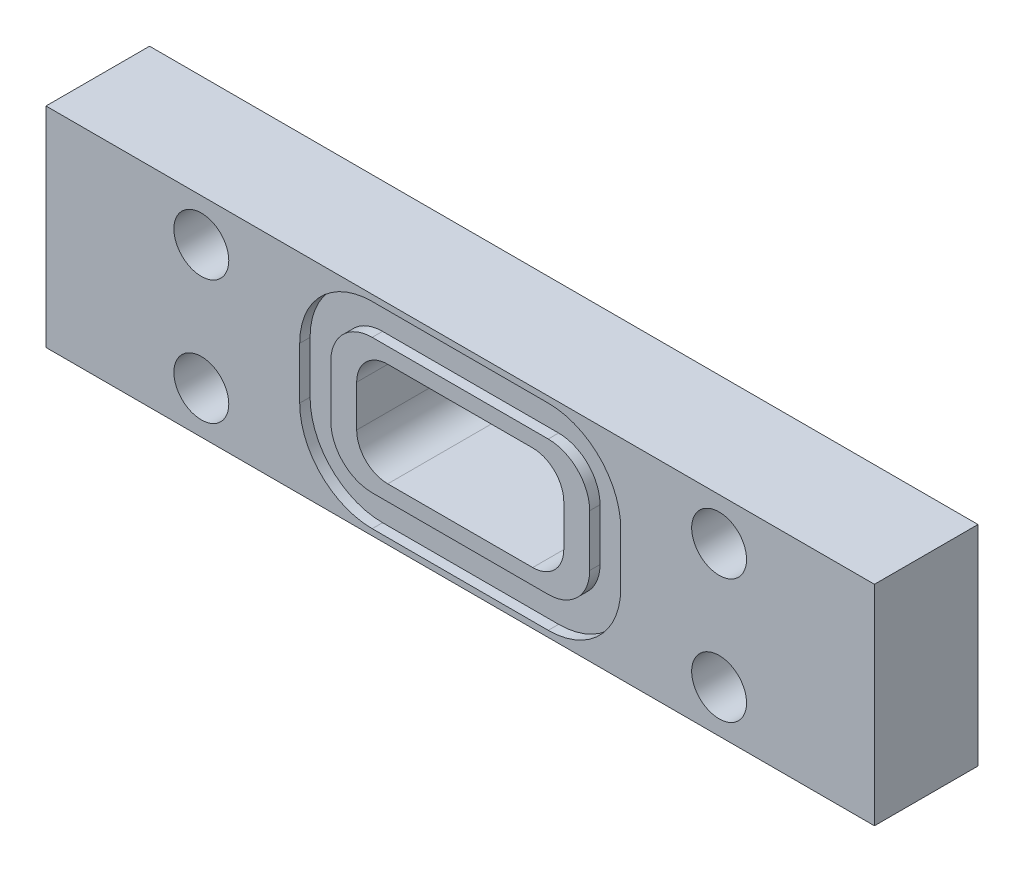
ISO-10303-21;
HEADER;
FILE_DESCRIPTION(('STEP AP214'),'2;1');
FILE_NAME('part.step','',(''),(''),'','','');
FILE_SCHEMA(('AUTOMOTIVE_DESIGN { 1 0 10303 214 1 1 1 1 }'));
ENDSEC;
DATA;
#1=APPLICATION_CONTEXT('core data for automotive mechanical design processes');
#2=APPLICATION_PROTOCOL_DEFINITION('international standard','automotive_design',2000,#1);
#3=PRODUCT_CONTEXT('',#1,'mechanical');
#4=PRODUCT('Part','Part','',(#3));
#5=PRODUCT_RELATED_PRODUCT_CATEGORY('part','',(#4));
#6=PRODUCT_DEFINITION_FORMATION('','',#4);
#7=PRODUCT_DEFINITION_CONTEXT('part definition',#1,'design');
#8=PRODUCT_DEFINITION('design','',#6,#7);
#9=PRODUCT_DEFINITION_SHAPE('','',#8);
#10=(LENGTH_UNIT() NAMED_UNIT(*) SI_UNIT(.MILLI.,.METRE.));
#11=(NAMED_UNIT(*) PLANE_ANGLE_UNIT() SI_UNIT($,.RADIAN.));
#12=(NAMED_UNIT(*) SI_UNIT($,.STERADIAN.) SOLID_ANGLE_UNIT());
#13=UNCERTAINTY_MEASURE_WITH_UNIT(LENGTH_MEASURE(1.E-05),#10,'distance_accuracy_value','');
#14=(GEOMETRIC_REPRESENTATION_CONTEXT(3) GLOBAL_UNCERTAINTY_ASSIGNED_CONTEXT((#13)) GLOBAL_UNIT_ASSIGNED_CONTEXT((#10,
#11,#12)) REPRESENTATION_CONTEXT('',''));
#15=CARTESIAN_POINT('',(0.,0.,0.));
#16=DIRECTION('',(0.,0.,1.));
#17=DIRECTION('',(1.,0.,0.));
#18=AXIS2_PLACEMENT_3D('',#15,#16,#17);
#19=CARTESIAN_POINT('',(0.,0.,10.));
#20=DIRECTION('',(0.,0.,-1.));
#21=DIRECTION('',(-1.,0.,0.));
#22=AXIS2_PLACEMENT_3D('',#19,#20,#21);
#23=PLANE('',#22);
#24=DIRECTION('',(0.,1.,0.));
#25=VECTOR('',#24,1.);
#26=CARTESIAN_POINT('',(50.,15.1,10.));
#27=LINE('',#26,#25);
#28=CARTESIAN_POINT('',(50.,8.1,10.));
#29=VERTEX_POINT('',#28);
#30=CARTESIAN_POINT('',(50.,12.1,10.));
#31=VERTEX_POINT('',#30);
#32=EDGE_CURVE('E389',#29,#31,#27,.T.);
#33=ORIENTED_EDGE('',*,*,#32,.F.);
#34=CARTESIAN_POINT('',(47.,8.1,10.));
#35=DIRECTION('',(0.,0.,-1.));
#36=DIRECTION('',(-1.,0.,0.));
#37=AXIS2_PLACEMENT_3D('',#34,#35,#36);
#38=CIRCLE('',#37,3.);
#39=CARTESIAN_POINT('',(47.,5.1,10.));
#40=VERTEX_POINT('',#39);
#41=EDGE_CURVE('E464',#29,#40,#38,.T.);
#42=ORIENTED_EDGE('',*,*,#41,.T.);
#43=DIRECTION('',(1.,0.,0.));
#44=VECTOR('',#43,1.);
#45=CARTESIAN_POINT('',(30.,5.1,10.));
#46=LINE('',#45,#44);
#47=CARTESIAN_POINT('',(33.,5.1,10.));
#48=VERTEX_POINT('',#47);
#49=EDGE_CURVE('E399',#48,#40,#46,.T.);
#50=ORIENTED_EDGE('',*,*,#49,.F.);
#51=CARTESIAN_POINT('',(33.,8.1,10.));
#52=DIRECTION('',(0.,0.,-1.));
#53=DIRECTION('',(-1.,0.,0.));
#54=AXIS2_PLACEMENT_3D('',#51,#52,#53);
#55=CIRCLE('',#54,3.);
#56=CARTESIAN_POINT('',(30.,8.1,10.));
#57=VERTEX_POINT('',#56);
#58=EDGE_CURVE('E468',#48,#57,#55,.T.);
#59=ORIENTED_EDGE('',*,*,#58,.T.);
#60=DIRECTION('',(0.,-1.,0.));
#61=VECTOR('',#60,1.);
#62=CARTESIAN_POINT('',(30.,15.1,10.));
#63=LINE('',#62,#61);
#64=CARTESIAN_POINT('',(30.,12.1,10.));
#65=VERTEX_POINT('',#64);
#66=EDGE_CURVE('E396',#65,#57,#63,.T.);
#67=ORIENTED_EDGE('',*,*,#66,.F.);
#68=CARTESIAN_POINT('',(33.,12.1,10.));
#69=DIRECTION('',(0.,0.,-1.));
#70=DIRECTION('',(-1.,0.,0.));
#71=AXIS2_PLACEMENT_3D('',#68,#69,#70);
#72=CIRCLE('',#71,3.);
#73=CARTESIAN_POINT('',(33.,15.1,10.));
#74=VERTEX_POINT('',#73);
#75=EDGE_CURVE('E13',#65,#74,#72,.T.);
#76=ORIENTED_EDGE('',*,*,#75,.T.);
#77=DIRECTION('',(-1.,0.,0.));
#78=VECTOR('',#77,1.);
#79=CARTESIAN_POINT('',(30.,15.1,10.));
#80=LINE('',#79,#78);
#81=CARTESIAN_POINT('',(47.,15.1,10.));
#82=VERTEX_POINT('',#81);
#83=EDGE_CURVE('E392',#82,#74,#80,.T.);
#84=ORIENTED_EDGE('',*,*,#83,.F.);
#85=CARTESIAN_POINT('',(47.,12.1,10.));
#86=DIRECTION('',(0.,0.,-1.));
#87=DIRECTION('',(-1.,0.,0.));
#88=AXIS2_PLACEMENT_3D('',#85,#86,#87);
#89=CIRCLE('',#88,3.);
#90=EDGE_CURVE('E472',#82,#31,#89,.T.);
#91=ORIENTED_EDGE('',*,*,#90,.T.);
#92=EDGE_LOOP('',(#33,#42,#50,#59,#67,#76,#84,#91));
#93=FACE_BOUND('',#92,.T.);
#94=CARTESIAN_POINT('',(48.5,12.6,10.));
#95=DIRECTION('',(0.,0.,1.));
#96=DIRECTION('',(-1.,0.,0.));
#97=AXIS2_PLACEMENT_3D('',#94,#95,#96);
#98=CIRCLE('',#97,4.);
#99=CARTESIAN_POINT('',(52.5,12.6,10.));
#100=VERTEX_POINT('',#99);
#101=CARTESIAN_POINT('',(48.5,16.6,10.));
#102=VERTEX_POINT('',#101);
#103=EDGE_CURVE('E275',#100,#102,#98,.T.);
#104=ORIENTED_EDGE('',*,*,#103,.T.);
#105=DIRECTION('',(-1.,0.,0.));
#106=VECTOR('',#105,1.);
#107=CARTESIAN_POINT('',(48.5,16.6,10.));
#108=LINE('',#107,#106);
#109=CARTESIAN_POINT('',(31.5,16.6,10.));
#110=VERTEX_POINT('',#109);
#111=EDGE_CURVE('E234',#102,#110,#108,.T.);
#112=ORIENTED_EDGE('',*,*,#111,.T.);
#113=CARTESIAN_POINT('',(31.5,12.6,10.));
#114=DIRECTION('',(0.,0.,1.));
#115=DIRECTION('',(1.,0.,0.));
#116=AXIS2_PLACEMENT_3D('',#113,#114,#115);
#117=CIRCLE('',#116,4.);
#118=CARTESIAN_POINT('',(27.5,12.6,10.));
#119=VERTEX_POINT('',#118);
#120=EDGE_CURVE('E67',#110,#119,#117,.T.);
#121=ORIENTED_EDGE('',*,*,#120,.T.);
#122=DIRECTION('',(0.,-1.,0.));
#123=VECTOR('',#122,1.);
#124=CARTESIAN_POINT('',(27.5,12.6,10.));
#125=LINE('',#124,#123);
#126=CARTESIAN_POINT('',(27.5,7.60000000000003,10.));
#127=VERTEX_POINT('',#126);
#128=EDGE_CURVE('E279',#119,#127,#125,.T.);
#129=ORIENTED_EDGE('',*,*,#128,.T.);
#130=CARTESIAN_POINT('',(31.5,7.6,10.));
#131=DIRECTION('',(0.,0.,1.));
#132=DIRECTION('',(-1.,0.,0.));
#133=AXIS2_PLACEMENT_3D('',#130,#131,#132);
#134=CIRCLE('',#133,4.);
#135=CARTESIAN_POINT('',(31.5,3.6,10.));
#136=VERTEX_POINT('',#135);
#137=EDGE_CURVE('E282',#127,#136,#134,.T.);
#138=ORIENTED_EDGE('',*,*,#137,.T.);
#139=DIRECTION('',(1.,0.,0.));
#140=VECTOR('',#139,1.);
#141=CARTESIAN_POINT('',(48.5,3.6,10.));
#142=LINE('',#141,#140);
#143=CARTESIAN_POINT('',(48.5,3.6,10.));
#144=VERTEX_POINT('',#143);
#145=EDGE_CURVE('E285',#136,#144,#142,.T.);
#146=ORIENTED_EDGE('',*,*,#145,.T.);
#147=CARTESIAN_POINT('',(48.5,7.6,10.));
#148=DIRECTION('',(0.,0.,1.));
#149=DIRECTION('',(-1.,0.,0.));
#150=AXIS2_PLACEMENT_3D('',#147,#148,#149);
#151=CIRCLE('',#150,4.);
#152=CARTESIAN_POINT('',(52.5,7.60000000000003,10.));
#153=VERTEX_POINT('',#152);
#154=EDGE_CURVE('E258',#144,#153,#151,.T.);
#155=ORIENTED_EDGE('',*,*,#154,.T.);
#156=DIRECTION('',(0.,1.,0.));
#157=VECTOR('',#156,1.);
#158=CARTESIAN_POINT('',(52.5,12.6,10.));
#159=LINE('',#158,#157);
#160=EDGE_CURVE('E255',#153,#100,#159,.T.);
#161=ORIENTED_EDGE('',*,*,#160,.T.);
#162=EDGE_LOOP('',(#104,#112,#121,#129,#138,#146,#155,#161));
#163=FACE_BOUND('',#162,.T.);
#164=ADVANCED_FACE('F44',(#93,#163),#23,.F.);
#165=DIRECTION('',(-1.,0.,0.));
#166=VECTOR('',#165,1.);
#167=CARTESIAN_POINT('',(48.5,19.6,10.));
#168=LINE('',#167,#166);
#169=CARTESIAN_POINT('',(48.5,19.6,10.));
#170=VERTEX_POINT('',#169);
#171=CARTESIAN_POINT('',(31.5,19.6,10.));
#172=VERTEX_POINT('',#171);
#173=EDGE_CURVE('E329',#170,#172,#168,.T.);
#174=ORIENTED_EDGE('',*,*,#173,.F.);
#175=CARTESIAN_POINT('',(48.5,12.6,10.));
#176=DIRECTION('',(0.,0.,1.));
#177=DIRECTION('',(-1.,0.,0.));
#178=AXIS2_PLACEMENT_3D('',#175,#176,#177);
#179=CIRCLE('',#178,7.);
#180=CARTESIAN_POINT('',(55.5,12.6,10.));
#181=VERTEX_POINT('',#180);
#182=EDGE_CURVE('E59',#181,#170,#179,.T.);
#183=ORIENTED_EDGE('',*,*,#182,.F.);
#184=DIRECTION('',(0.,1.,0.));
#185=VECTOR('',#184,1.);
#186=CARTESIAN_POINT('',(55.5,12.6,10.));
#187=LINE('',#186,#185);
#188=CARTESIAN_POINT('',(55.5,7.60000000000003,10.));
#189=VERTEX_POINT('',#188);
#190=EDGE_CURVE('E306',#189,#181,#187,.T.);
#191=ORIENTED_EDGE('',*,*,#190,.F.);
#192=CARTESIAN_POINT('',(48.5,7.6,10.));
#193=DIRECTION('',(0.,0.,1.));
#194=DIRECTION('',(-1.,0.,0.));
#195=AXIS2_PLACEMENT_3D('',#192,#193,#194);
#196=CIRCLE('',#195,7.);
#197=CARTESIAN_POINT('',(48.4999999999999,0.6,10.));
#198=VERTEX_POINT('',#197);
#199=EDGE_CURVE('E344',#198,#189,#196,.T.);
#200=ORIENTED_EDGE('',*,*,#199,.F.);
#201=DIRECTION('',(1.,0.,0.));
#202=VECTOR('',#201,1.);
#203=CARTESIAN_POINT('',(48.4999999999999,0.600000000000001,10.));
#204=LINE('',#203,#202);
#205=CARTESIAN_POINT('',(31.5,0.6,10.));
#206=VERTEX_POINT('',#205);
#207=EDGE_CURVE('E341',#206,#198,#204,.T.);
#208=ORIENTED_EDGE('',*,*,#207,.F.);
#209=CARTESIAN_POINT('',(31.5,7.6,10.));
#210=DIRECTION('',(0.,0.,1.));
#211=DIRECTION('',(-1.,0.,0.));
#212=AXIS2_PLACEMENT_3D('',#209,#210,#211);
#213=CIRCLE('',#212,7.);
#214=CARTESIAN_POINT('',(24.5,7.6,10.));
#215=VERTEX_POINT('',#214);
#216=EDGE_CURVE('E338',#215,#206,#213,.T.);
#217=ORIENTED_EDGE('',*,*,#216,.F.);
#218=DIRECTION('',(0.,-1.,0.));
#219=VECTOR('',#218,1.);
#220=CARTESIAN_POINT('',(24.5,12.6,10.));
#221=LINE('',#220,#219);
#222=CARTESIAN_POINT('',(24.5,12.6,10.));
#223=VERTEX_POINT('',#222);
#224=EDGE_CURVE('E335',#223,#215,#221,.T.);
#225=ORIENTED_EDGE('',*,*,#224,.F.);
#226=CARTESIAN_POINT('',(31.5,12.6,10.));
#227=DIRECTION('',(0.,0.,1.));
#228=DIRECTION('',(1.,0.,0.));
#229=AXIS2_PLACEMENT_3D('',#226,#227,#228);
#230=CIRCLE('',#229,7.);
#231=EDGE_CURVE('E332',#172,#223,#230,.T.);
#232=ORIENTED_EDGE('',*,*,#231,.F.);
#233=EDGE_LOOP('',(#174,#183,#191,#200,#208,#217,#225,#232));
#234=FACE_BOUND('',#233,.T.);
#235=DIRECTION('',(0.,-1.,0.));
#236=VECTOR('',#235,1.);
#237=CARTESIAN_POINT('',(0.,0.,10.));
#238=LINE('',#237,#236);
#239=CARTESIAN_POINT('',(0.,20.2,10.));
#240=VERTEX_POINT('',#239);
#241=CARTESIAN_POINT('',(0.,0.,10.));
#242=VERTEX_POINT('',#241);
#243=EDGE_CURVE('E413',#240,#242,#238,.T.);
#244=ORIENTED_EDGE('',*,*,#243,.T.);
#245=DIRECTION('',(1.,0.,0.));
#246=VECTOR('',#245,1.);
#247=CARTESIAN_POINT('',(0.,0.,10.));
#248=LINE('',#247,#246);
#249=CARTESIAN_POINT('',(80.,0.,10.));
#250=VERTEX_POINT('',#249);
#251=EDGE_CURVE('E416',#242,#250,#248,.T.);
#252=ORIENTED_EDGE('',*,*,#251,.T.);
#253=DIRECTION('',(0.,1.,0.));
#254=VECTOR('',#253,1.);
#255=CARTESIAN_POINT('',(80.,0.,10.));
#256=LINE('',#255,#254);
#257=CARTESIAN_POINT('',(80.,20.2,10.));
#258=VERTEX_POINT('',#257);
#259=EDGE_CURVE('E419',#250,#258,#256,.T.);
#260=ORIENTED_EDGE('',*,*,#259,.T.);
#261=DIRECTION('',(-1.,0.,0.));
#262=VECTOR('',#261,1.);
#263=CARTESIAN_POINT('',(0.,20.2,10.));
#264=LINE('',#263,#262);
#265=EDGE_CURVE('E421',#258,#240,#264,.T.);
#266=ORIENTED_EDGE('',*,*,#265,.T.);
#267=EDGE_LOOP('',(#244,#252,#260,#266));
#268=FACE_BOUND('',#267,.T.);
#269=CARTESIAN_POINT('',(15.,16.1,10.));
#270=DIRECTION('',(0.,0.,1.));
#271=DIRECTION('',(1.,0.,0.));
#272=AXIS2_PLACEMENT_3D('',#269,#270,#271);
#273=CIRCLE('',#272,2.65);
#274=CARTESIAN_POINT('',(17.65,16.1,10.));
#275=VERTEX_POINT('',#274);
#276=EDGE_CURVE('E383',#275,#275,#273,.T.);
#277=ORIENTED_EDGE('',*,*,#276,.F.);
#278=EDGE_LOOP('',(#277));
#279=FACE_BOUND('',#278,.T.);
#280=CARTESIAN_POINT('',(15.,4.1,10.));
#281=DIRECTION('',(0.,0.,1.));
#282=DIRECTION('',(1.,0.,0.));
#283=AXIS2_PLACEMENT_3D('',#280,#281,#282);
#284=CIRCLE('',#283,2.65);
#285=CARTESIAN_POINT('',(17.65,4.1,10.));
#286=VERTEX_POINT('',#285);
#287=EDGE_CURVE('E377',#286,#286,#284,.T.);
#288=ORIENTED_EDGE('',*,*,#287,.F.);
#289=EDGE_LOOP('',(#288));
#290=FACE_BOUND('',#289,.T.);
#291=CARTESIAN_POINT('',(65.,16.1,10.));
#292=DIRECTION('',(0.,0.,1.));
#293=DIRECTION('',(1.,0.,0.));
#294=AXIS2_PLACEMENT_3D('',#291,#292,#293);
#295=CIRCLE('',#294,2.65);
#296=CARTESIAN_POINT('',(67.65,16.1,10.));
#297=VERTEX_POINT('',#296);
#298=EDGE_CURVE('E371',#297,#297,#295,.T.);
#299=ORIENTED_EDGE('',*,*,#298,.F.);
#300=EDGE_LOOP('',(#299));
#301=FACE_BOUND('',#300,.T.);
#302=CARTESIAN_POINT('',(65.,4.1,10.));
#303=DIRECTION('',(0.,0.,1.));
#304=DIRECTION('',(1.,0.,0.));
#305=AXIS2_PLACEMENT_3D('',#302,#303,#304);
#306=CIRCLE('',#305,2.65);
#307=CARTESIAN_POINT('',(67.65,4.1,10.));
#308=VERTEX_POINT('',#307);
#309=EDGE_CURVE('E365',#308,#308,#306,.T.);
#310=ORIENTED_EDGE('',*,*,#309,.F.);
#311=EDGE_LOOP('',(#310));
#312=FACE_BOUND('',#311,.T.);
#313=ADVANCED_FACE('F522',(#234,#268,#279,#290,#301,#312),#23,.F.);
#314=CARTESIAN_POINT('',(0.,0.,0.));
#315=DIRECTION('',(0.,0.,-1.));
#316=DIRECTION('',(-1.,0.,0.));
#317=AXIS2_PLACEMENT_3D('',#314,#315,#316);
#318=PLANE('',#317);
#319=CARTESIAN_POINT('',(65.,16.1,0.));
#320=DIRECTION('',(0.,0.,1.));
#321=DIRECTION('',(1.,0.,0.));
#322=AXIS2_PLACEMENT_3D('',#319,#320,#321);
#323=CIRCLE('',#322,2.65);
#324=CARTESIAN_POINT('',(67.65,16.1,0.));
#325=VERTEX_POINT('',#324);
#326=EDGE_CURVE('E368',#325,#325,#323,.T.);
#327=ORIENTED_EDGE('',*,*,#326,.T.);
#328=EDGE_LOOP('',(#327));
#329=FACE_BOUND('',#328,.T.);
#330=CARTESIAN_POINT('',(15.,16.1,0.));
#331=DIRECTION('',(0.,0.,1.));
#332=DIRECTION('',(1.,0.,0.));
#333=AXIS2_PLACEMENT_3D('',#330,#331,#332);
#334=CIRCLE('',#333,2.65);
#335=CARTESIAN_POINT('',(17.65,16.1,0.));
#336=VERTEX_POINT('',#335);
#337=EDGE_CURVE('E380',#336,#336,#334,.T.);
#338=ORIENTED_EDGE('',*,*,#337,.T.);
#339=EDGE_LOOP('',(#338));
#340=FACE_BOUND('',#339,.T.);
#341=DIRECTION('',(0.,-1.,0.));
#342=VECTOR('',#341,1.);
#343=CARTESIAN_POINT('',(0.,0.,0.));
#344=LINE('',#343,#342);
#345=CARTESIAN_POINT('',(0.,20.2,0.));
#346=VERTEX_POINT('',#345);
#347=CARTESIAN_POINT('',(0.,0.,0.));
#348=VERTEX_POINT('',#347);
#349=EDGE_CURVE('E402',#346,#348,#344,.T.);
#350=ORIENTED_EDGE('',*,*,#349,.F.);
#351=DIRECTION('',(-1.,0.,0.));
#352=VECTOR('',#351,1.);
#353=CARTESIAN_POINT('',(0.,20.2,0.));
#354=LINE('',#353,#352);
#355=CARTESIAN_POINT('',(80.,20.2,0.));
#356=VERTEX_POINT('',#355);
#357=EDGE_CURVE('E417',#356,#346,#354,.T.);
#358=ORIENTED_EDGE('',*,*,#357,.F.);
#359=DIRECTION('',(0.,1.,0.));
#360=VECTOR('',#359,1.);
#361=CARTESIAN_POINT('',(80.,0.,0.));
#362=LINE('',#361,#360);
#363=CARTESIAN_POINT('',(80.,0.,0.));
#364=VERTEX_POINT('',#363);
#365=EDGE_CURVE('E428',#364,#356,#362,.T.);
#366=ORIENTED_EDGE('',*,*,#365,.F.);
#367=DIRECTION('',(1.,0.,0.));
#368=VECTOR('',#367,1.);
#369=CARTESIAN_POINT('',(0.,0.,0.));
#370=LINE('',#369,#368);
#371=EDGE_CURVE('E426',#348,#364,#370,.T.);
#372=ORIENTED_EDGE('',*,*,#371,.F.);
#373=EDGE_LOOP('',(#350,#358,#366,#372));
#374=FACE_BOUND('',#373,.T.);
#375=DIRECTION('',(0.,-1.,0.));
#376=VECTOR('',#375,1.);
#377=CARTESIAN_POINT('',(30.,15.1,0.));
#378=LINE('',#377,#376);
#379=CARTESIAN_POINT('',(30.,12.1,0.));
#380=VERTEX_POINT('',#379);
#381=CARTESIAN_POINT('',(30.,8.1,0.));
#382=VERTEX_POINT('',#381);
#383=EDGE_CURVE('E408',#380,#382,#378,.T.);
#384=ORIENTED_EDGE('',*,*,#383,.T.);
#385=CARTESIAN_POINT('',(33.,8.1,0.));
#386=DIRECTION('',(0.,0.,-1.));
#387=DIRECTION('',(-1.,0.,0.));
#388=AXIS2_PLACEMENT_3D('',#385,#386,#387);
#389=CIRCLE('',#388,3.);
#390=CARTESIAN_POINT('',(33.,5.1,0.));
#391=VERTEX_POINT('',#390);
#392=EDGE_CURVE('E466',#382,#391,#389,.F.);
#393=ORIENTED_EDGE('',*,*,#392,.T.);
#394=DIRECTION('',(1.,0.,0.));
#395=VECTOR('',#394,1.);
#396=CARTESIAN_POINT('',(30.,5.1,0.));
#397=LINE('',#396,#395);
#398=CARTESIAN_POINT('',(47.,5.1,0.));
#399=VERTEX_POINT('',#398);
#400=EDGE_CURVE('E393',#391,#399,#397,.T.);
#401=ORIENTED_EDGE('',*,*,#400,.T.);
#402=CARTESIAN_POINT('',(47.,8.1,0.));
#403=DIRECTION('',(0.,0.,-1.));
#404=DIRECTION('',(-1.,0.,0.));
#405=AXIS2_PLACEMENT_3D('',#402,#403,#404);
#406=CIRCLE('',#405,3.);
#407=CARTESIAN_POINT('',(50.,8.1,0.));
#408=VERTEX_POINT('',#407);
#409=EDGE_CURVE('E462',#399,#408,#406,.F.);
#410=ORIENTED_EDGE('',*,*,#409,.T.);
#411=DIRECTION('',(0.,1.,0.));
#412=VECTOR('',#411,1.);
#413=CARTESIAN_POINT('',(50.,15.1,0.));
#414=LINE('',#413,#412);
#415=CARTESIAN_POINT('',(50.,12.1,0.));
#416=VERTEX_POINT('',#415);
#417=EDGE_CURVE('E386',#408,#416,#414,.T.);
#418=ORIENTED_EDGE('',*,*,#417,.T.);
#419=CARTESIAN_POINT('',(47.,12.1,0.));
#420=DIRECTION('',(0.,0.,-1.));
#421=DIRECTION('',(-1.,0.,0.));
#422=AXIS2_PLACEMENT_3D('',#419,#420,#421);
#423=CIRCLE('',#422,3.);
#424=CARTESIAN_POINT('',(47.,15.1,0.));
#425=VERTEX_POINT('',#424);
#426=EDGE_CURVE('E470',#416,#425,#423,.F.);
#427=ORIENTED_EDGE('',*,*,#426,.T.);
#428=DIRECTION('',(-1.,0.,0.));
#429=VECTOR('',#428,1.);
#430=CARTESIAN_POINT('',(30.,15.1,0.));
#431=LINE('',#430,#429);
#432=CARTESIAN_POINT('',(33.,15.1,0.));
#433=VERTEX_POINT('',#432);
#434=EDGE_CURVE('E405',#425,#433,#431,.T.);
#435=ORIENTED_EDGE('',*,*,#434,.T.);
#436=CARTESIAN_POINT('',(33.,12.1,0.));
#437=DIRECTION('',(0.,0.,-1.));
#438=DIRECTION('',(-1.,0.,0.));
#439=AXIS2_PLACEMENT_3D('',#436,#437,#438);
#440=CIRCLE('',#439,3.);
#441=EDGE_CURVE('E52',#433,#380,#440,.F.);
#442=ORIENTED_EDGE('',*,*,#441,.T.);
#443=EDGE_LOOP('',(#384,#393,#401,#410,#418,#427,#435,#442));
#444=FACE_BOUND('',#443,.T.);
#445=CARTESIAN_POINT('',(15.,4.1,0.));
#446=DIRECTION('',(0.,0.,1.));
#447=DIRECTION('',(1.,0.,0.));
#448=AXIS2_PLACEMENT_3D('',#445,#446,#447);
#449=CIRCLE('',#448,2.65);
#450=CARTESIAN_POINT('',(17.65,4.1,0.));
#451=VERTEX_POINT('',#450);
#452=EDGE_CURVE('E374',#451,#451,#449,.T.);
#453=ORIENTED_EDGE('',*,*,#452,.T.);
#454=EDGE_LOOP('',(#453));
#455=FACE_BOUND('',#454,.T.);
#456=CARTESIAN_POINT('',(65.,4.1,0.));
#457=DIRECTION('',(0.,0.,1.));
#458=DIRECTION('',(1.,0.,0.));
#459=AXIS2_PLACEMENT_3D('',#456,#457,#458);
#460=CIRCLE('',#459,2.65);
#461=CARTESIAN_POINT('',(67.65,4.1,0.));
#462=VERTEX_POINT('',#461);
#463=EDGE_CURVE('E351',#462,#462,#460,.T.);
#464=ORIENTED_EDGE('',*,*,#463,.T.);
#465=EDGE_LOOP('',(#464));
#466=FACE_BOUND('',#465,.T.);
#467=ADVANCED_FACE('F475',(#329,#340,#374,#444,#455,#466),#318,.T.);
#468=CARTESIAN_POINT('',(0.,0.,10.));
#469=DIRECTION('',(1.,0.,0.));
#470=DIRECTION('',(0.,0.,-1.));
#471=AXIS2_PLACEMENT_3D('',#468,#469,#470);
#472=PLANE('',#471);
#473=ORIENTED_EDGE('',*,*,#349,.T.);
#474=DIRECTION('',(0.,0.,-1.));
#475=VECTOR('',#474,1.);
#476=CARTESIAN_POINT('',(0.,0.,10.));
#477=LINE('',#476,#475);
#478=EDGE_CURVE('E439',#242,#348,#477,.T.);
#479=ORIENTED_EDGE('',*,*,#478,.F.);
#480=ORIENTED_EDGE('',*,*,#243,.F.);
#481=DIRECTION('',(0.,0.,-1.));
#482=VECTOR('',#481,1.);
#483=CARTESIAN_POINT('',(0.,20.2,10.));
#484=LINE('',#483,#482);
#485=EDGE_CURVE('E423',#240,#346,#484,.T.);
#486=ORIENTED_EDGE('',*,*,#485,.T.);
#487=EDGE_LOOP('',(#473,#479,#480,#486));
#488=FACE_BOUND('',#487,.T.);
#489=ADVANCED_FACE('F534',(#488),#472,.F.);
#490=CARTESIAN_POINT('',(0.,0.,10.));
#491=DIRECTION('',(0.,1.,0.));
#492=DIRECTION('',(0.,0.,1.));
#493=AXIS2_PLACEMENT_3D('',#490,#491,#492);
#494=PLANE('',#493);
#495=ORIENTED_EDGE('',*,*,#371,.T.);
#496=DIRECTION('',(0.,0.,-1.));
#497=VECTOR('',#496,1.);
#498=CARTESIAN_POINT('',(80.,0.,10.));
#499=LINE('',#498,#497);
#500=EDGE_CURVE('E436',#250,#364,#499,.T.);
#501=ORIENTED_EDGE('',*,*,#500,.F.);
#502=ORIENTED_EDGE('',*,*,#251,.F.);
#503=ORIENTED_EDGE('',*,*,#478,.T.);
#504=EDGE_LOOP('',(#495,#501,#502,#503));
#505=FACE_BOUND('',#504,.T.);
#506=ADVANCED_FACE('F543',(#505),#494,.F.);
#507=CARTESIAN_POINT('',(80.,0.,10.));
#508=DIRECTION('',(-1.,0.,0.));
#509=DIRECTION('',(0.,0.,1.));
#510=AXIS2_PLACEMENT_3D('',#507,#508,#509);
#511=PLANE('',#510);
#512=ORIENTED_EDGE('',*,*,#365,.T.);
#513=DIRECTION('',(0.,0.,-1.));
#514=VECTOR('',#513,1.);
#515=CARTESIAN_POINT('',(80.,20.2,10.));
#516=LINE('',#515,#514);
#517=EDGE_CURVE('E433',#258,#356,#516,.T.);
#518=ORIENTED_EDGE('',*,*,#517,.F.);
#519=ORIENTED_EDGE('',*,*,#259,.F.);
#520=ORIENTED_EDGE('',*,*,#500,.T.);
#521=EDGE_LOOP('',(#512,#518,#519,#520));
#522=FACE_BOUND('',#521,.T.);
#523=ADVANCED_FACE('F539',(#522),#511,.F.);
#524=CARTESIAN_POINT('',(0.,20.2,10.));
#525=DIRECTION('',(0.,-1.,0.));
#526=DIRECTION('',(0.,0.,-1.));
#527=AXIS2_PLACEMENT_3D('',#524,#525,#526);
#528=PLANE('',#527);
#529=ORIENTED_EDGE('',*,*,#357,.T.);
#530=ORIENTED_EDGE('',*,*,#485,.F.);
#531=ORIENTED_EDGE('',*,*,#265,.F.);
#532=ORIENTED_EDGE('',*,*,#517,.T.);
#533=EDGE_LOOP('',(#529,#530,#531,#532));
#534=FACE_BOUND('',#533,.T.);
#535=ADVANCED_FACE('F536',(#534),#528,.F.);
#536=CARTESIAN_POINT('',(50.,15.1,10.));
#537=DIRECTION('',(-1.,0.,0.));
#538=DIRECTION('',(0.,0.,1.));
#539=AXIS2_PLACEMENT_3D('',#536,#537,#538);
#540=PLANE('',#539);
#541=ORIENTED_EDGE('',*,*,#417,.F.);
#542=DIRECTION('',(0.,0.,-1.));
#543=VECTOR('',#542,1.);
#544=CARTESIAN_POINT('',(50.,8.1,10.));
#545=LINE('',#544,#543);
#546=EDGE_CURVE('E450',#408,#29,#545,.F.);
#547=ORIENTED_EDGE('',*,*,#546,.T.);
#548=ORIENTED_EDGE('',*,*,#32,.T.);
#549=DIRECTION('',(0.,0.,-1.));
#550=VECTOR('',#549,1.);
#551=CARTESIAN_POINT('',(50.,12.1,0.));
#552=LINE('',#551,#550);
#553=EDGE_CURVE('E447',#31,#416,#552,.T.);
#554=ORIENTED_EDGE('',*,*,#553,.T.);
#555=EDGE_LOOP('',(#541,#547,#548,#554));
#556=FACE_BOUND('',#555,.T.);
#557=ADVANCED_FACE('F500',(#556),#540,.T.);
#558=CARTESIAN_POINT('',(30.,15.1,10.));
#559=DIRECTION('',(0.,-1.,0.));
#560=DIRECTION('',(0.,0.,-1.));
#561=AXIS2_PLACEMENT_3D('',#558,#559,#560);
#562=PLANE('',#561);
#563=ORIENTED_EDGE('',*,*,#434,.F.);
#564=DIRECTION('',(0.,0.,-1.));
#565=VECTOR('',#564,1.);
#566=CARTESIAN_POINT('',(47.,15.1,10.));
#567=LINE('',#566,#565);
#568=EDGE_CURVE('E460',#425,#82,#567,.F.);
#569=ORIENTED_EDGE('',*,*,#568,.T.);
#570=ORIENTED_EDGE('',*,*,#83,.T.);
#571=DIRECTION('',(0.,0.,-1.));
#572=VECTOR('',#571,1.);
#573=CARTESIAN_POINT('',(33.,15.1,0.));
#574=LINE('',#573,#572);
#575=EDGE_CURVE('E457',#74,#433,#574,.T.);
#576=ORIENTED_EDGE('',*,*,#575,.T.);
#577=EDGE_LOOP('',(#563,#569,#570,#576));
#578=FACE_BOUND('',#577,.T.);
#579=ADVANCED_FACE('F492',(#578),#562,.T.);
#580=CARTESIAN_POINT('',(30.,15.1,10.));
#581=DIRECTION('',(1.,0.,0.));
#582=DIRECTION('',(0.,0.,-1.));
#583=AXIS2_PLACEMENT_3D('',#580,#581,#582);
#584=PLANE('',#583);
#585=ORIENTED_EDGE('',*,*,#66,.T.);
#586=DIRECTION('',(0.,0.,-1.));
#587=VECTOR('',#586,1.);
#588=CARTESIAN_POINT('',(30.,8.1,0.));
#589=LINE('',#588,#587);
#590=EDGE_CURVE('E454',#57,#382,#589,.T.);
#591=ORIENTED_EDGE('',*,*,#590,.T.);
#592=ORIENTED_EDGE('',*,*,#383,.F.);
#593=DIRECTION('',(0.,0.,-1.));
#594=VECTOR('',#593,1.);
#595=CARTESIAN_POINT('',(30.,12.1,10.));
#596=LINE('',#595,#594);
#597=EDGE_CURVE('E452',#380,#65,#596,.F.);
#598=ORIENTED_EDGE('',*,*,#597,.T.);
#599=EDGE_LOOP('',(#585,#591,#592,#598));
#600=FACE_BOUND('',#599,.T.);
#601=ADVANCED_FACE('F482',(#600),#584,.T.);
#602=CARTESIAN_POINT('',(30.,5.1,10.));
#603=DIRECTION('',(0.,1.,0.));
#604=DIRECTION('',(0.,0.,1.));
#605=AXIS2_PLACEMENT_3D('',#602,#603,#604);
#606=PLANE('',#605);
#607=ORIENTED_EDGE('',*,*,#49,.T.);
#608=DIRECTION('',(0.,0.,-1.));
#609=VECTOR('',#608,1.);
#610=CARTESIAN_POINT('',(47.,5.1,0.));
#611=LINE('',#610,#609);
#612=EDGE_CURVE('E444',#40,#399,#611,.T.);
#613=ORIENTED_EDGE('',*,*,#612,.T.);
#614=ORIENTED_EDGE('',*,*,#400,.F.);
#615=DIRECTION('',(0.,0.,-1.));
#616=VECTOR('',#615,1.);
#617=CARTESIAN_POINT('',(33.,5.1,10.));
#618=LINE('',#617,#616);
#619=EDGE_CURVE('E442',#391,#48,#618,.F.);
#620=ORIENTED_EDGE('',*,*,#619,.T.);
#621=EDGE_LOOP('',(#607,#613,#614,#620));
#622=FACE_BOUND('',#621,.T.);
#623=ADVANCED_FACE('F508',(#622),#606,.T.);
#624=CARTESIAN_POINT('',(15.,16.1,10.));
#625=DIRECTION('',(0.,0.,-1.));
#626=DIRECTION('',(-1.,0.,0.));
#627=AXIS2_PLACEMENT_3D('',#624,#625,#626);
#628=CYLINDRICAL_SURFACE('',#627,2.65);
#629=ORIENTED_EDGE('',*,*,#276,.T.);
#630=EDGE_LOOP('',(#629));
#631=FACE_BOUND('',#630,.T.);
#632=ORIENTED_EDGE('',*,*,#337,.F.);
#633=EDGE_LOOP('',(#632));
#634=FACE_BOUND('',#633,.T.);
#635=ADVANCED_FACE('F591',(#631,#634),#628,.F.);
#636=CARTESIAN_POINT('',(15.,4.1,10.));
#637=DIRECTION('',(0.,0.,-1.));
#638=DIRECTION('',(-1.,0.,0.));
#639=AXIS2_PLACEMENT_3D('',#636,#637,#638);
#640=CYLINDRICAL_SURFACE('',#639,2.65);
#641=ORIENTED_EDGE('',*,*,#287,.T.);
#642=EDGE_LOOP('',(#641));
#643=FACE_BOUND('',#642,.T.);
#644=ORIENTED_EDGE('',*,*,#452,.F.);
#645=EDGE_LOOP('',(#644));
#646=FACE_BOUND('',#645,.T.);
#647=ADVANCED_FACE('F582',(#643,#646),#640,.F.);
#648=CARTESIAN_POINT('',(65.,16.1,10.));
#649=DIRECTION('',(0.,0.,-1.));
#650=DIRECTION('',(-1.,0.,0.));
#651=AXIS2_PLACEMENT_3D('',#648,#649,#650);
#652=CYLINDRICAL_SURFACE('',#651,2.65);
#653=ORIENTED_EDGE('',*,*,#298,.T.);
#654=EDGE_LOOP('',(#653));
#655=FACE_BOUND('',#654,.T.);
#656=ORIENTED_EDGE('',*,*,#326,.F.);
#657=EDGE_LOOP('',(#656));
#658=FACE_BOUND('',#657,.T.);
#659=ADVANCED_FACE('F575',(#655,#658),#652,.F.);
#660=CARTESIAN_POINT('',(65.,4.1,10.));
#661=DIRECTION('',(0.,0.,-1.));
#662=DIRECTION('',(-1.,0.,0.));
#663=AXIS2_PLACEMENT_3D('',#660,#661,#662);
#664=CYLINDRICAL_SURFACE('',#663,2.65);
#665=ORIENTED_EDGE('',*,*,#309,.T.);
#666=EDGE_LOOP('',(#665));
#667=FACE_BOUND('',#666,.T.);
#668=ORIENTED_EDGE('',*,*,#463,.F.);
#669=EDGE_LOOP('',(#668));
#670=FACE_BOUND('',#669,.T.);
#671=ADVANCED_FACE('F519',(#667,#670),#664,.F.);
#672=CARTESIAN_POINT('',(47.,8.1,10.));
#673=DIRECTION('',(0.,0.,1.));
#674=DIRECTION('',(1.,0.,0.));
#675=AXIS2_PLACEMENT_3D('',#672,#673,#674);
#676=CYLINDRICAL_SURFACE('',#675,3.);
#677=ORIENTED_EDGE('',*,*,#41,.F.);
#678=ORIENTED_EDGE('',*,*,#546,.F.);
#679=ORIENTED_EDGE('',*,*,#409,.F.);
#680=ORIENTED_EDGE('',*,*,#612,.F.);
#681=EDGE_LOOP('',(#677,#678,#679,#680));
#682=FACE_BOUND('',#681,.T.);
#683=ADVANCED_FACE('F503',(#682),#676,.F.);
#684=CARTESIAN_POINT('',(33.,8.1,10.));
#685=DIRECTION('',(0.,0.,1.));
#686=DIRECTION('',(1.,0.,0.));
#687=AXIS2_PLACEMENT_3D('',#684,#685,#686);
#688=CYLINDRICAL_SURFACE('',#687,3.);
#689=ORIENTED_EDGE('',*,*,#58,.F.);
#690=ORIENTED_EDGE('',*,*,#619,.F.);
#691=ORIENTED_EDGE('',*,*,#392,.F.);
#692=ORIENTED_EDGE('',*,*,#590,.F.);
#693=EDGE_LOOP('',(#689,#690,#691,#692));
#694=FACE_BOUND('',#693,.T.);
#695=ADVANCED_FACE('F512',(#694),#688,.F.);
#696=CARTESIAN_POINT('',(47.,12.1,10.));
#697=DIRECTION('',(0.,0.,1.));
#698=DIRECTION('',(1.,0.,0.));
#699=AXIS2_PLACEMENT_3D('',#696,#697,#698);
#700=CYLINDRICAL_SURFACE('',#699,3.);
#701=ORIENTED_EDGE('',*,*,#90,.F.);
#702=ORIENTED_EDGE('',*,*,#568,.F.);
#703=ORIENTED_EDGE('',*,*,#426,.F.);
#704=ORIENTED_EDGE('',*,*,#553,.F.);
#705=EDGE_LOOP('',(#701,#702,#703,#704));
#706=FACE_BOUND('',#705,.T.);
#707=ADVANCED_FACE('F495',(#706),#700,.F.);
#708=CARTESIAN_POINT('',(33.,12.1,10.));
#709=DIRECTION('',(0.,0.,1.));
#710=DIRECTION('',(1.,0.,0.));
#711=AXIS2_PLACEMENT_3D('',#708,#709,#710);
#712=CYLINDRICAL_SURFACE('',#711,3.);
#713=ORIENTED_EDGE('',*,*,#75,.F.);
#714=ORIENTED_EDGE('',*,*,#597,.F.);
#715=ORIENTED_EDGE('',*,*,#441,.F.);
#716=ORIENTED_EDGE('',*,*,#575,.F.);
#717=EDGE_LOOP('',(#713,#714,#715,#716));
#718=FACE_BOUND('',#717,.T.);
#719=ADVANCED_FACE('F46',(#718),#712,.F.);
#720=CARTESIAN_POINT('',(48.5,12.6,9.));
#721=DIRECTION('',(0.,0.,1.));
#722=DIRECTION('',(1.,0.,0.));
#723=AXIS2_PLACEMENT_3D('',#720,#721,#722);
#724=CYLINDRICAL_SURFACE('',#723,7.);
#725=ORIENTED_EDGE('',*,*,#182,.T.);
#726=DIRECTION('',(0.,0.,1.));
#727=VECTOR('',#726,1.);
#728=CARTESIAN_POINT('',(48.5,19.6,9.));
#729=LINE('',#728,#727);
#730=CARTESIAN_POINT('',(48.5,19.6,9.));
#731=VERTEX_POINT('',#730);
#732=EDGE_CURVE('E327',#731,#170,#729,.T.);
#733=ORIENTED_EDGE('',*,*,#732,.F.);
#734=CARTESIAN_POINT('',(48.5,12.6,9.));
#735=DIRECTION('',(0.,0.,1.));
#736=DIRECTION('',(-1.,0.,0.));
#737=AXIS2_PLACEMENT_3D('',#734,#735,#736);
#738=CIRCLE('',#737,7.);
#739=CARTESIAN_POINT('',(55.5,12.6,9.));
#740=VERTEX_POINT('',#739);
#741=EDGE_CURVE('E302',#740,#731,#738,.T.);
#742=ORIENTED_EDGE('',*,*,#741,.F.);
#743=DIRECTION('',(0.,0.,1.));
#744=VECTOR('',#743,1.);
#745=CARTESIAN_POINT('',(55.5,12.6,9.));
#746=LINE('',#745,#744);
#747=EDGE_CURVE('E349',#740,#181,#746,.T.);
#748=ORIENTED_EDGE('',*,*,#747,.T.);
#749=EDGE_LOOP('',(#725,#733,#742,#748));
#750=FACE_BOUND('',#749,.T.);
#751=ADVANCED_FACE('F586',(#750),#724,.F.);
#752=CARTESIAN_POINT('',(55.5,12.6,9.));
#753=DIRECTION('',(1.,0.,0.));
#754=DIRECTION('',(0.,0.,-1.));
#755=AXIS2_PLACEMENT_3D('',#752,#753,#754);
#756=PLANE('',#755);
#757=ORIENTED_EDGE('',*,*,#190,.T.);
#758=ORIENTED_EDGE('',*,*,#747,.F.);
#759=DIRECTION('',(0.,1.,0.));
#760=VECTOR('',#759,1.);
#761=CARTESIAN_POINT('',(55.5,12.6,9.));
#762=LINE('',#761,#760);
#763=CARTESIAN_POINT('',(55.5,7.60000000000003,9.));
#764=VERTEX_POINT('',#763);
#765=EDGE_CURVE('E324',#764,#740,#762,.T.);
#766=ORIENTED_EDGE('',*,*,#765,.F.);
#767=DIRECTION('',(0.,0.,1.));
#768=VECTOR('',#767,1.);
#769=CARTESIAN_POINT('',(55.5,7.60000000000003,9.));
#770=LINE('',#769,#768);
#771=EDGE_CURVE('E352',#764,#189,#770,.T.);
#772=ORIENTED_EDGE('',*,*,#771,.T.);
#773=EDGE_LOOP('',(#757,#758,#766,#772));
#774=FACE_BOUND('',#773,.T.);
#775=ADVANCED_FACE('F643',(#774),#756,.F.);
#776=CARTESIAN_POINT('',(48.5,7.6,9.));
#777=DIRECTION('',(0.,0.,1.));
#778=DIRECTION('',(1.,0.,0.));
#779=AXIS2_PLACEMENT_3D('',#776,#777,#778);
#780=CYLINDRICAL_SURFACE('',#779,7.);
#781=ORIENTED_EDGE('',*,*,#199,.T.);
#782=ORIENTED_EDGE('',*,*,#771,.F.);
#783=CARTESIAN_POINT('',(48.5,7.6,9.));
#784=DIRECTION('',(0.,0.,1.));
#785=DIRECTION('',(-1.,0.,0.));
#786=AXIS2_PLACEMENT_3D('',#783,#784,#785);
#787=CIRCLE('',#786,7.);
#788=CARTESIAN_POINT('',(48.4999999999999,0.6,9.));
#789=VERTEX_POINT('',#788);
#790=EDGE_CURVE('E321',#789,#764,#787,.T.);
#791=ORIENTED_EDGE('',*,*,#790,.F.);
#792=DIRECTION('',(0.,0.,1.));
#793=VECTOR('',#792,1.);
#794=CARTESIAN_POINT('',(48.4999999999999,0.6,9.));
#795=LINE('',#794,#793);
#796=EDGE_CURVE('E354',#789,#198,#795,.T.);
#797=ORIENTED_EDGE('',*,*,#796,.T.);
#798=EDGE_LOOP('',(#781,#782,#791,#797));
#799=FACE_BOUND('',#798,.T.);
#800=ADVANCED_FACE('F652',(#799),#780,.F.);
#801=CARTESIAN_POINT('',(48.4999999999999,0.600000000000001,9.));
#802=DIRECTION('',(0.,-1.,0.));
#803=DIRECTION('',(1.,0.,0.));
#804=AXIS2_PLACEMENT_3D('',#801,#802,#803);
#805=PLANE('',#804);
#806=ORIENTED_EDGE('',*,*,#207,.T.);
#807=ORIENTED_EDGE('',*,*,#796,.F.);
#808=DIRECTION('',(1.,0.,0.));
#809=VECTOR('',#808,1.);
#810=CARTESIAN_POINT('',(48.4999999999999,0.600000000000001,9.));
#811=LINE('',#810,#809);
#812=CARTESIAN_POINT('',(31.5,0.6,9.));
#813=VERTEX_POINT('',#812);
#814=EDGE_CURVE('E318',#813,#789,#811,.T.);
#815=ORIENTED_EDGE('',*,*,#814,.F.);
#816=DIRECTION('',(0.,0.,1.));
#817=VECTOR('',#816,1.);
#818=CARTESIAN_POINT('',(31.5,0.6,9.));
#819=LINE('',#818,#817);
#820=EDGE_CURVE('E356',#813,#206,#819,.T.);
#821=ORIENTED_EDGE('',*,*,#820,.T.);
#822=EDGE_LOOP('',(#806,#807,#815,#821));
#823=FACE_BOUND('',#822,.T.);
#824=ADVANCED_FACE('F662',(#823),#805,.F.);
#825=CARTESIAN_POINT('',(31.5,7.6,9.));
#826=DIRECTION('',(0.,0.,1.));
#827=DIRECTION('',(1.,0.,0.));
#828=AXIS2_PLACEMENT_3D('',#825,#826,#827);
#829=CYLINDRICAL_SURFACE('',#828,7.);
#830=ORIENTED_EDGE('',*,*,#216,.T.);
#831=ORIENTED_EDGE('',*,*,#820,.F.);
#832=CARTESIAN_POINT('',(31.5,7.6,9.));
#833=DIRECTION('',(0.,0.,1.));
#834=DIRECTION('',(-1.,0.,0.));
#835=AXIS2_PLACEMENT_3D('',#832,#833,#834);
#836=CIRCLE('',#835,7.);
#837=CARTESIAN_POINT('',(24.5,7.6,9.));
#838=VERTEX_POINT('',#837);
#839=EDGE_CURVE('E315',#838,#813,#836,.T.);
#840=ORIENTED_EDGE('',*,*,#839,.F.);
#841=DIRECTION('',(0.,0.,1.));
#842=VECTOR('',#841,1.);
#843=CARTESIAN_POINT('',(24.5,7.6,9.));
#844=LINE('',#843,#842);
#845=EDGE_CURVE('E358',#838,#215,#844,.T.);
#846=ORIENTED_EDGE('',*,*,#845,.T.);
#847=EDGE_LOOP('',(#830,#831,#840,#846));
#848=FACE_BOUND('',#847,.T.);
#849=ADVANCED_FACE('F672',(#848),#829,.F.);
#850=CARTESIAN_POINT('',(24.5,12.6,9.));
#851=DIRECTION('',(-1.,0.,0.));
#852=DIRECTION('',(0.,-1.,0.));
#853=AXIS2_PLACEMENT_3D('',#850,#851,#852);
#854=PLANE('',#853);
#855=ORIENTED_EDGE('',*,*,#224,.T.);
#856=ORIENTED_EDGE('',*,*,#845,.F.);
#857=DIRECTION('',(0.,-1.,0.));
#858=VECTOR('',#857,1.);
#859=CARTESIAN_POINT('',(24.5,12.6,9.));
#860=LINE('',#859,#858);
#861=CARTESIAN_POINT('',(24.5,12.6,9.));
#862=VERTEX_POINT('',#861);
#863=EDGE_CURVE('E312',#862,#838,#860,.T.);
#864=ORIENTED_EDGE('',*,*,#863,.F.);
#865=DIRECTION('',(0.,0.,1.));
#866=VECTOR('',#865,1.);
#867=CARTESIAN_POINT('',(24.5,12.6,9.));
#868=LINE('',#867,#866);
#869=EDGE_CURVE('E360',#862,#223,#868,.T.);
#870=ORIENTED_EDGE('',*,*,#869,.T.);
#871=EDGE_LOOP('',(#855,#856,#864,#870));
#872=FACE_BOUND('',#871,.T.);
#873=ADVANCED_FACE('F682',(#872),#854,.F.);
#874=CARTESIAN_POINT('',(31.5,12.6,9.));
#875=DIRECTION('',(0.,0.,1.));
#876=DIRECTION('',(1.,0.,0.));
#877=AXIS2_PLACEMENT_3D('',#874,#875,#876);
#878=CYLINDRICAL_SURFACE('',#877,7.);
#879=ORIENTED_EDGE('',*,*,#231,.T.);
#880=ORIENTED_EDGE('',*,*,#869,.F.);
#881=CARTESIAN_POINT('',(31.5,12.6,9.));
#882=DIRECTION('',(0.,0.,1.));
#883=DIRECTION('',(1.,0.,0.));
#884=AXIS2_PLACEMENT_3D('',#881,#882,#883);
#885=CIRCLE('',#884,7.);
#886=CARTESIAN_POINT('',(31.5,19.6,9.));
#887=VERTEX_POINT('',#886);
#888=EDGE_CURVE('E309',#887,#862,#885,.T.);
#889=ORIENTED_EDGE('',*,*,#888,.F.);
#890=DIRECTION('',(0.,0.,1.));
#891=VECTOR('',#890,1.);
#892=CARTESIAN_POINT('',(31.5,19.6,9.));
#893=LINE('',#892,#891);
#894=EDGE_CURVE('E362',#887,#172,#893,.T.);
#895=ORIENTED_EDGE('',*,*,#894,.T.);
#896=EDGE_LOOP('',(#879,#880,#889,#895));
#897=FACE_BOUND('',#896,.T.);
#898=ADVANCED_FACE('F692',(#897),#878,.F.);
#899=CARTESIAN_POINT('',(48.5,19.6,9.));
#900=DIRECTION('',(0.,1.,0.));
#901=DIRECTION('',(0.,0.,1.));
#902=AXIS2_PLACEMENT_3D('',#899,#900,#901);
#903=PLANE('',#902);
#904=ORIENTED_EDGE('',*,*,#173,.T.);
#905=ORIENTED_EDGE('',*,*,#894,.F.);
#906=DIRECTION('',(-1.,0.,0.));
#907=VECTOR('',#906,1.);
#908=CARTESIAN_POINT('',(48.5,19.6,9.));
#909=LINE('',#908,#907);
#910=EDGE_CURVE('E305',#731,#887,#909,.T.);
#911=ORIENTED_EDGE('',*,*,#910,.F.);
#912=ORIENTED_EDGE('',*,*,#732,.T.);
#913=EDGE_LOOP('',(#904,#905,#911,#912));
#914=FACE_BOUND('',#913,.T.);
#915=ADVANCED_FACE('F702',(#914),#903,.F.);
#916=CARTESIAN_POINT('',(48.5,12.6,9.));
#917=DIRECTION('',(0.,0.,-1.));
#918=DIRECTION('',(-1.,0.,0.));
#919=AXIS2_PLACEMENT_3D('',#916,#917,#918);
#920=PLANE('',#919);
#921=CARTESIAN_POINT('',(48.5,12.6,9.));
#922=DIRECTION('',(0.,0.,1.));
#923=DIRECTION('',(-1.,0.,0.));
#924=AXIS2_PLACEMENT_3D('',#921,#922,#923);
#925=CIRCLE('',#924,4.);
#926=CARTESIAN_POINT('',(52.5,12.6,9.));
#927=VERTEX_POINT('',#926);
#928=CARTESIAN_POINT('',(48.5,16.6,9.));
#929=VERTEX_POINT('',#928);
#930=EDGE_CURVE('E247',#927,#929,#925,.T.);
#931=ORIENTED_EDGE('',*,*,#930,.F.);
#932=DIRECTION('',(0.,1.,0.));
#933=VECTOR('',#932,1.);
#934=CARTESIAN_POINT('',(52.5,12.6,9.));
#935=LINE('',#934,#933);
#936=CARTESIAN_POINT('',(52.5,7.60000000000003,9.));
#937=VERTEX_POINT('',#936);
#938=EDGE_CURVE('E240',#937,#927,#935,.T.);
#939=ORIENTED_EDGE('',*,*,#938,.F.);
#940=CARTESIAN_POINT('',(48.5,7.6,9.));
#941=DIRECTION('',(0.,0.,1.));
#942=DIRECTION('',(-1.,0.,0.));
#943=AXIS2_PLACEMENT_3D('',#940,#941,#942);
#944=CIRCLE('',#943,4.);
#945=CARTESIAN_POINT('',(48.5,3.6,9.));
#946=VERTEX_POINT('',#945);
#947=EDGE_CURVE('E271',#946,#937,#944,.T.);
#948=ORIENTED_EDGE('',*,*,#947,.F.);
#949=DIRECTION('',(1.,0.,0.));
#950=VECTOR('',#949,1.);
#951=CARTESIAN_POINT('',(48.5,3.6,9.));
#952=LINE('',#951,#950);
#953=CARTESIAN_POINT('',(31.5,3.6,9.));
#954=VERTEX_POINT('',#953);
#955=EDGE_CURVE('E268',#954,#946,#952,.T.);
#956=ORIENTED_EDGE('',*,*,#955,.F.);
#957=CARTESIAN_POINT('',(31.5,7.6,9.));
#958=DIRECTION('',(0.,0.,1.));
#959=DIRECTION('',(-1.,0.,0.));
#960=AXIS2_PLACEMENT_3D('',#957,#958,#959);
#961=CIRCLE('',#960,4.);
#962=CARTESIAN_POINT('',(27.5,7.60000000000003,9.));
#963=VERTEX_POINT('',#962);
#964=EDGE_CURVE('E265',#963,#954,#961,.T.);
#965=ORIENTED_EDGE('',*,*,#964,.F.);
#966=DIRECTION('',(0.,-1.,0.));
#967=VECTOR('',#966,1.);
#968=CARTESIAN_POINT('',(27.5,12.6,9.));
#969=LINE('',#968,#967);
#970=CARTESIAN_POINT('',(27.5,12.6,9.));
#971=VERTEX_POINT('',#970);
#972=EDGE_CURVE('E262',#971,#963,#969,.T.);
#973=ORIENTED_EDGE('',*,*,#972,.F.);
#974=CARTESIAN_POINT('',(31.5,12.6,9.));
#975=DIRECTION('',(0.,0.,1.));
#976=DIRECTION('',(1.,0.,0.));
#977=AXIS2_PLACEMENT_3D('',#974,#975,#976);
#978=CIRCLE('',#977,4.);
#979=CARTESIAN_POINT('',(31.5,16.6,9.));
#980=VERTEX_POINT('',#979);
#981=EDGE_CURVE('E251',#980,#971,#978,.T.);
#982=ORIENTED_EDGE('',*,*,#981,.F.);
#983=DIRECTION('',(-1.,0.,0.));
#984=VECTOR('',#983,1.);
#985=CARTESIAN_POINT('',(48.5,16.6,9.));
#986=LINE('',#985,#984);
#987=EDGE_CURVE('E232',#929,#980,#986,.T.);
#988=ORIENTED_EDGE('',*,*,#987,.F.);
#989=EDGE_LOOP('',(#931,#939,#948,#956,#965,#973,#982,#988));
#990=FACE_BOUND('',#989,.T.);
#991=ORIENTED_EDGE('',*,*,#741,.T.);
#992=ORIENTED_EDGE('',*,*,#910,.T.);
#993=ORIENTED_EDGE('',*,*,#888,.T.);
#994=ORIENTED_EDGE('',*,*,#863,.T.);
#995=ORIENTED_EDGE('',*,*,#839,.T.);
#996=ORIENTED_EDGE('',*,*,#814,.T.);
#997=ORIENTED_EDGE('',*,*,#790,.T.);
#998=ORIENTED_EDGE('',*,*,#765,.T.);
#999=EDGE_LOOP('',(#991,#992,#993,#994,#995,#996,#997,#998));
#1000=FACE_BOUND('',#999,.T.);
#1001=ADVANCED_FACE('F244',(#990,#1000),#920,.F.);
#1002=CARTESIAN_POINT('',(48.5,12.6,9.));
#1003=DIRECTION('',(0.,0.,1.));
#1004=DIRECTION('',(1.,0.,0.));
#1005=AXIS2_PLACEMENT_3D('',#1002,#1003,#1004);
#1006=CYLINDRICAL_SURFACE('',#1005,4.);
#1007=ORIENTED_EDGE('',*,*,#103,.F.);
#1008=DIRECTION('',(0.,0.,1.));
#1009=VECTOR('',#1008,1.);
#1010=CARTESIAN_POINT('',(52.5,12.6,9.));
#1011=LINE('',#1010,#1009);
#1012=EDGE_CURVE('E254',#927,#100,#1011,.T.);
#1013=ORIENTED_EDGE('',*,*,#1012,.F.);
#1014=ORIENTED_EDGE('',*,*,#930,.T.);
#1015=DIRECTION('',(0.,0.,1.));
#1016=VECTOR('',#1015,1.);
#1017=CARTESIAN_POINT('',(48.5,16.6,9.));
#1018=LINE('',#1017,#1016);
#1019=EDGE_CURVE('E229',#929,#102,#1018,.T.);
#1020=ORIENTED_EDGE('',*,*,#1019,.T.);
#1021=EDGE_LOOP('',(#1007,#1013,#1014,#1020));
#1022=FACE_BOUND('',#1021,.T.);
#1023=ADVANCED_FACE('F253',(#1022),#1006,.T.);
#1024=CARTESIAN_POINT('',(52.5,12.6,9.));
#1025=DIRECTION('',(1.,0.,0.));
#1026=DIRECTION('',(0.,0.,-1.));
#1027=AXIS2_PLACEMENT_3D('',#1024,#1025,#1026);
#1028=PLANE('',#1027);
#1029=ORIENTED_EDGE('',*,*,#160,.F.);
#1030=DIRECTION('',(0.,0.,1.));
#1031=VECTOR('',#1030,1.);
#1032=CARTESIAN_POINT('',(52.5,7.60000000000003,9.));
#1033=LINE('',#1032,#1031);
#1034=EDGE_CURVE('E291',#937,#153,#1033,.T.);
#1035=ORIENTED_EDGE('',*,*,#1034,.F.);
#1036=ORIENTED_EDGE('',*,*,#938,.T.);
#1037=ORIENTED_EDGE('',*,*,#1012,.T.);
#1038=EDGE_LOOP('',(#1029,#1035,#1036,#1037));
#1039=FACE_BOUND('',#1038,.T.);
#1040=ADVANCED_FACE('F728',(#1039),#1028,.T.);
#1041=CARTESIAN_POINT('',(48.5,7.6,9.));
#1042=DIRECTION('',(0.,0.,1.));
#1043=DIRECTION('',(1.,0.,0.));
#1044=AXIS2_PLACEMENT_3D('',#1041,#1042,#1043);
#1045=CYLINDRICAL_SURFACE('',#1044,4.);
#1046=ORIENTED_EDGE('',*,*,#154,.F.);
#1047=DIRECTION('',(0.,0.,1.));
#1048=VECTOR('',#1047,1.);
#1049=CARTESIAN_POINT('',(48.5,3.6,9.));
#1050=LINE('',#1049,#1048);
#1051=EDGE_CURVE('E293',#946,#144,#1050,.T.);
#1052=ORIENTED_EDGE('',*,*,#1051,.F.);
#1053=ORIENTED_EDGE('',*,*,#947,.T.);
#1054=ORIENTED_EDGE('',*,*,#1034,.T.);
#1055=EDGE_LOOP('',(#1046,#1052,#1053,#1054));
#1056=FACE_BOUND('',#1055,.T.);
#1057=ADVANCED_FACE('F737',(#1056),#1045,.T.);
#1058=CARTESIAN_POINT('',(48.5,3.6,9.));
#1059=DIRECTION('',(0.,-1.,0.));
#1060=DIRECTION('',(0.,0.,-1.));
#1061=AXIS2_PLACEMENT_3D('',#1058,#1059,#1060);
#1062=PLANE('',#1061);
#1063=ORIENTED_EDGE('',*,*,#145,.F.);
#1064=DIRECTION('',(0.,0.,1.));
#1065=VECTOR('',#1064,1.);
#1066=CARTESIAN_POINT('',(31.5,3.6,9.));
#1067=LINE('',#1066,#1065);
#1068=EDGE_CURVE('E295',#954,#136,#1067,.T.);
#1069=ORIENTED_EDGE('',*,*,#1068,.F.);
#1070=ORIENTED_EDGE('',*,*,#955,.T.);
#1071=ORIENTED_EDGE('',*,*,#1051,.T.);
#1072=EDGE_LOOP('',(#1063,#1069,#1070,#1071));
#1073=FACE_BOUND('',#1072,.T.);
#1074=ADVANCED_FACE('F747',(#1073),#1062,.T.);
#1075=CARTESIAN_POINT('',(31.5,7.6,9.));
#1076=DIRECTION('',(0.,0.,1.));
#1077=DIRECTION('',(1.,0.,0.));
#1078=AXIS2_PLACEMENT_3D('',#1075,#1076,#1077);
#1079=CYLINDRICAL_SURFACE('',#1078,4.);
#1080=ORIENTED_EDGE('',*,*,#137,.F.);
#1081=DIRECTION('',(0.,0.,1.));
#1082=VECTOR('',#1081,1.);
#1083=CARTESIAN_POINT('',(27.5,7.60000000000003,9.));
#1084=LINE('',#1083,#1082);
#1085=EDGE_CURVE('E297',#963,#127,#1084,.T.);
#1086=ORIENTED_EDGE('',*,*,#1085,.F.);
#1087=ORIENTED_EDGE('',*,*,#964,.T.);
#1088=ORIENTED_EDGE('',*,*,#1068,.T.);
#1089=EDGE_LOOP('',(#1080,#1086,#1087,#1088));
#1090=FACE_BOUND('',#1089,.T.);
#1091=ADVANCED_FACE('F757',(#1090),#1079,.T.);
#1092=CARTESIAN_POINT('',(27.5,12.6,9.));
#1093=DIRECTION('',(-1.,0.,0.));
#1094=DIRECTION('',(0.,0.,1.));
#1095=AXIS2_PLACEMENT_3D('',#1092,#1093,#1094);
#1096=PLANE('',#1095);
#1097=ORIENTED_EDGE('',*,*,#128,.F.);
#1098=DIRECTION('',(0.,0.,1.));
#1099=VECTOR('',#1098,1.);
#1100=CARTESIAN_POINT('',(27.5,12.6,9.));
#1101=LINE('',#1100,#1099);
#1102=EDGE_CURVE('E299',#971,#119,#1101,.T.);
#1103=ORIENTED_EDGE('',*,*,#1102,.F.);
#1104=ORIENTED_EDGE('',*,*,#972,.T.);
#1105=ORIENTED_EDGE('',*,*,#1085,.T.);
#1106=EDGE_LOOP('',(#1097,#1103,#1104,#1105));
#1107=FACE_BOUND('',#1106,.T.);
#1108=ADVANCED_FACE('F767',(#1107),#1096,.T.);
#1109=CARTESIAN_POINT('',(31.5,12.6,9.));
#1110=DIRECTION('',(0.,0.,1.));
#1111=DIRECTION('',(1.,0.,0.));
#1112=AXIS2_PLACEMENT_3D('',#1109,#1110,#1111);
#1113=CYLINDRICAL_SURFACE('',#1112,4.);
#1114=ORIENTED_EDGE('',*,*,#120,.F.);
#1115=DIRECTION('',(0.,0.,1.));
#1116=VECTOR('',#1115,1.);
#1117=CARTESIAN_POINT('',(31.5,16.6,9.));
#1118=LINE('',#1117,#1116);
#1119=EDGE_CURVE('E239',#980,#110,#1118,.T.);
#1120=ORIENTED_EDGE('',*,*,#1119,.F.);
#1121=ORIENTED_EDGE('',*,*,#981,.T.);
#1122=ORIENTED_EDGE('',*,*,#1102,.T.);
#1123=EDGE_LOOP('',(#1114,#1120,#1121,#1122));
#1124=FACE_BOUND('',#1123,.T.);
#1125=ADVANCED_FACE('F777',(#1124),#1113,.T.);
#1126=CARTESIAN_POINT('',(48.5,16.6,9.));
#1127=DIRECTION('',(0.,1.,0.));
#1128=DIRECTION('',(0.,0.,1.));
#1129=AXIS2_PLACEMENT_3D('',#1126,#1127,#1128);
#1130=PLANE('',#1129);
#1131=ORIENTED_EDGE('',*,*,#111,.F.);
#1132=ORIENTED_EDGE('',*,*,#1019,.F.);
#1133=ORIENTED_EDGE('',*,*,#987,.T.);
#1134=ORIENTED_EDGE('',*,*,#1119,.T.);
#1135=EDGE_LOOP('',(#1131,#1132,#1133,#1134));
#1136=FACE_BOUND('',#1135,.T.);
#1137=ADVANCED_FACE('F231',(#1136),#1130,.T.);
#1138=CLOSED_SHELL('',(#164,#313,#467,#489,#506,#523,#535,#557,#579,#601,#623,#635,#647,#659,
#671,#683,#695,#707,#719,#751,#775,#800,#824,#849,#873,#898,#915,#1001,#1023,#1040,#1057,#1074,
#1091,#1108,#1125,#1137));
#1139=MANIFOLD_SOLID_BREP('B2',#1138);
#1140=ADVANCED_BREP_SHAPE_REPRESENTATION('',(#18,#1139),#14);
#1141=SHAPE_DEFINITION_REPRESENTATION(#9,#1140);
ENDSEC;
END-ISO-10303-21;
